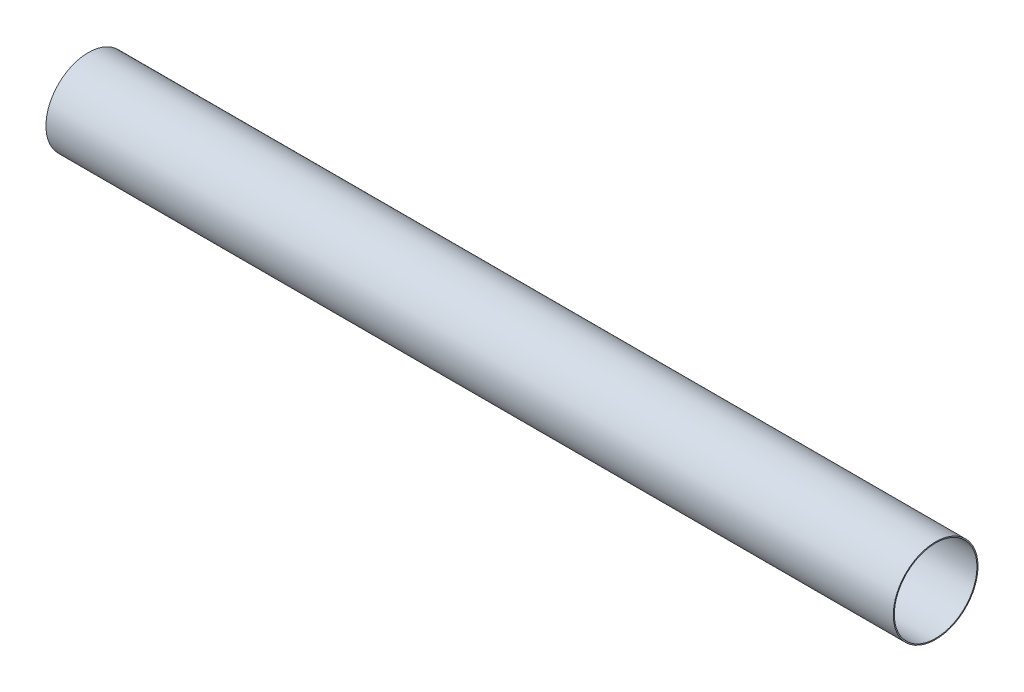
ISO-10303-21;
HEADER;
FILE_DESCRIPTION(('STEP AP214'),'2;1');
FILE_NAME('part.step','',(''),(''),'','','');
FILE_SCHEMA(('AUTOMOTIVE_DESIGN { 1 0 10303 214 1 1 1 1 }'));
ENDSEC;
DATA;
#1=APPLICATION_CONTEXT('core data for automotive mechanical design processes');
#2=APPLICATION_PROTOCOL_DEFINITION('international standard','automotive_design',2000,#1);
#3=PRODUCT_CONTEXT('',#1,'mechanical');
#4=PRODUCT('Part','Part','',(#3));
#5=PRODUCT_RELATED_PRODUCT_CATEGORY('part','',(#4));
#6=PRODUCT_DEFINITION_FORMATION('','',#4);
#7=PRODUCT_DEFINITION_CONTEXT('part definition',#1,'design');
#8=PRODUCT_DEFINITION('design','',#6,#7);
#9=PRODUCT_DEFINITION_SHAPE('','',#8);
#10=(LENGTH_UNIT() NAMED_UNIT(*) SI_UNIT(.MILLI.,.METRE.));
#11=(NAMED_UNIT(*) PLANE_ANGLE_UNIT() SI_UNIT($,.RADIAN.));
#12=(NAMED_UNIT(*) SI_UNIT($,.STERADIAN.) SOLID_ANGLE_UNIT());
#13=UNCERTAINTY_MEASURE_WITH_UNIT(LENGTH_MEASURE(1.E-05),#10,'distance_accuracy_value','');
#14=(GEOMETRIC_REPRESENTATION_CONTEXT(3) GLOBAL_UNCERTAINTY_ASSIGNED_CONTEXT((#13)) GLOBAL_UNIT_ASSIGNED_CONTEXT((#10,
#11,#12)) REPRESENTATION_CONTEXT('',''));
#15=CARTESIAN_POINT('',(0.,0.,0.));
#16=DIRECTION('',(0.,0.,1.));
#17=DIRECTION('',(1.,0.,0.));
#18=AXIS2_PLACEMENT_3D('',#15,#16,#17);
#19=CARTESIAN_POINT('',(3048.,0.,0.));
#20=DIRECTION('',(1.,0.,0.));
#21=DIRECTION('',(0.,0.,-1.));
#22=AXIS2_PLACEMENT_3D('',#19,#20,#21);
#23=PLANE('',#22);
#24=CARTESIAN_POINT('',(3048.,0.,0.));
#25=DIRECTION('',(1.,0.,0.));
#26=DIRECTION('',(0.,0.,-1.));
#27=AXIS2_PLACEMENT_3D('',#24,#25,#26);
#28=CIRCLE('',#27,152.4);
#29=CARTESIAN_POINT('',(3048.,0.,-152.4));
#30=VERTEX_POINT('',#29);
#31=EDGE_CURVE('E10',#30,#30,#28,.T.);
#32=ORIENTED_EDGE('',*,*,#31,.T.);
#33=EDGE_LOOP('',(#32));
#34=FACE_BOUND('',#33,.T.);
#35=CARTESIAN_POINT('',(3048.,0.,0.));
#36=DIRECTION('',(1.,0.,0.));
#37=DIRECTION('',(0.,0.,-1.));
#38=AXIS2_PLACEMENT_3D('',#35,#36,#37);
#39=CIRCLE('',#38,148.59);
#40=CARTESIAN_POINT('',(3048.,0.,-148.59));
#41=VERTEX_POINT('',#40);
#42=EDGE_CURVE('E45',#41,#41,#39,.T.);
#43=ORIENTED_EDGE('',*,*,#42,.F.);
#44=EDGE_LOOP('',(#43));
#45=FACE_BOUND('',#44,.T.);
#46=ADVANCED_FACE('F34',(#34,#45),#23,.T.);
#47=CARTESIAN_POINT('',(0.,0.,0.));
#48=DIRECTION('',(1.,0.,0.));
#49=DIRECTION('',(0.,0.,-1.));
#50=AXIS2_PLACEMENT_3D('',#47,#48,#49);
#51=PLANE('',#50);
#52=CARTESIAN_POINT('',(0.,0.,0.));
#53=DIRECTION('',(1.,0.,0.));
#54=DIRECTION('',(0.,0.,-1.));
#55=AXIS2_PLACEMENT_3D('',#52,#53,#54);
#56=CIRCLE('',#55,152.4);
#57=CARTESIAN_POINT('',(0.,0.,-152.4));
#58=VERTEX_POINT('',#57);
#59=EDGE_CURVE('E38',#58,#58,#56,.T.);
#60=ORIENTED_EDGE('',*,*,#59,.F.);
#61=EDGE_LOOP('',(#60));
#62=FACE_BOUND('',#61,.T.);
#63=CARTESIAN_POINT('',(0.,0.,0.));
#64=DIRECTION('',(1.,0.,0.));
#65=DIRECTION('',(0.,0.,-1.));
#66=AXIS2_PLACEMENT_3D('',#63,#64,#65);
#67=CIRCLE('',#66,148.59);
#68=CARTESIAN_POINT('',(0.,0.,-148.59));
#69=VERTEX_POINT('',#68);
#70=EDGE_CURVE('E47',#69,#69,#67,.T.);
#71=ORIENTED_EDGE('',*,*,#70,.T.);
#72=EDGE_LOOP('',(#71));
#73=FACE_BOUND('',#72,.T.);
#74=ADVANCED_FACE('F57',(#62,#73),#51,.F.);
#75=CARTESIAN_POINT('',(3048.,0.,0.));
#76=DIRECTION('',(-1.,0.,0.));
#77=DIRECTION('',(0.,0.,1.));
#78=AXIS2_PLACEMENT_3D('',#75,#76,#77);
#79=CYLINDRICAL_SURFACE('',#78,152.4);
#80=ORIENTED_EDGE('',*,*,#31,.F.);
#81=EDGE_LOOP('',(#80));
#82=FACE_BOUND('',#81,.T.);
#83=ORIENTED_EDGE('',*,*,#59,.T.);
#84=EDGE_LOOP('',(#83));
#85=FACE_BOUND('',#84,.T.);
#86=ADVANCED_FACE('F36',(#82,#85),#79,.T.);
#87=CARTESIAN_POINT('',(3048.,0.,0.));
#88=DIRECTION('',(-1.,0.,0.));
#89=DIRECTION('',(0.,0.,1.));
#90=AXIS2_PLACEMENT_3D('',#87,#88,#89);
#91=CYLINDRICAL_SURFACE('',#90,148.59);
#92=ORIENTED_EDGE('',*,*,#42,.T.);
#93=EDGE_LOOP('',(#92));
#94=FACE_BOUND('',#93,.T.);
#95=ORIENTED_EDGE('',*,*,#70,.F.);
#96=EDGE_LOOP('',(#95));
#97=FACE_BOUND('',#96,.T.);
#98=ADVANCED_FACE('F53',(#94,#97),#91,.F.);
#99=CLOSED_SHELL('',(#46,#74,#86,#98));
#100=MANIFOLD_SOLID_BREP('B2',#99);
#101=ADVANCED_BREP_SHAPE_REPRESENTATION('',(#18,#100),#14);
#102=SHAPE_DEFINITION_REPRESENTATION(#9,#101);
ENDSEC;
END-ISO-10303-21;
